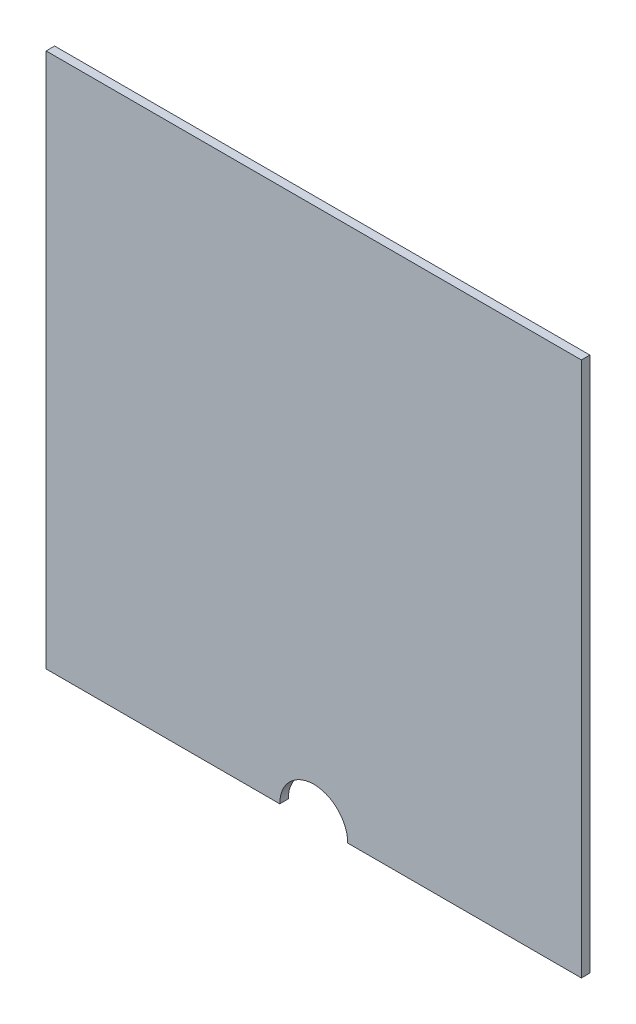
ISO-10303-21;
HEADER;
FILE_DESCRIPTION(('STEP AP214'),'2;1');
FILE_NAME('part.step','',(''),(''),'','','');
FILE_SCHEMA(('AUTOMOTIVE_DESIGN { 1 0 10303 214 1 1 1 1 }'));
ENDSEC;
DATA;
#1=APPLICATION_CONTEXT('core data for automotive mechanical design processes');
#2=APPLICATION_PROTOCOL_DEFINITION('international standard','automotive_design',2000,#1);
#3=PRODUCT_CONTEXT('',#1,'mechanical');
#4=PRODUCT('Part','Part','',(#3));
#5=PRODUCT_RELATED_PRODUCT_CATEGORY('part','',(#4));
#6=PRODUCT_DEFINITION_FORMATION('','',#4);
#7=PRODUCT_DEFINITION_CONTEXT('part definition',#1,'design');
#8=PRODUCT_DEFINITION('design','',#6,#7);
#9=PRODUCT_DEFINITION_SHAPE('','',#8);
#10=(LENGTH_UNIT() NAMED_UNIT(*) SI_UNIT(.MILLI.,.METRE.));
#11=(NAMED_UNIT(*) PLANE_ANGLE_UNIT() SI_UNIT($,.RADIAN.));
#12=(NAMED_UNIT(*) SI_UNIT($,.STERADIAN.) SOLID_ANGLE_UNIT());
#13=UNCERTAINTY_MEASURE_WITH_UNIT(LENGTH_MEASURE(1.E-05),#10,'distance_accuracy_value','');
#14=(GEOMETRIC_REPRESENTATION_CONTEXT(3) GLOBAL_UNCERTAINTY_ASSIGNED_CONTEXT((#13)) GLOBAL_UNIT_ASSIGNED_CONTEXT((#10,
#11,#12)) REPRESENTATION_CONTEXT('',''));
#15=CARTESIAN_POINT('',(0.,0.,0.));
#16=DIRECTION('',(0.,0.,1.));
#17=DIRECTION('',(1.,0.,0.));
#18=AXIS2_PLACEMENT_3D('',#15,#16,#17);
#19=CARTESIAN_POINT('',(99.9999999999999,0.,3.175));
#20=DIRECTION('',(0.,0.,-1.));
#21=DIRECTION('',(-1.,0.,0.));
#22=AXIS2_PLACEMENT_3D('',#19,#20,#21);
#23=CYLINDRICAL_SURFACE('',#22,12.7);
#24=CARTESIAN_POINT('',(99.9999999999999,0.,0.));
#25=DIRECTION('',(0.,0.,-1.));
#26=DIRECTION('',(1.,0.,0.));
#27=AXIS2_PLACEMENT_3D('',#24,#25,#26);
#28=CIRCLE('',#27,12.7);
#29=CARTESIAN_POINT('',(87.2999999999999,0.,0.));
#30=VERTEX_POINT('',#29);
#31=CARTESIAN_POINT('',(112.7,0.,0.));
#32=VERTEX_POINT('',#31);
#33=EDGE_CURVE('E119',#30,#32,#28,.T.);
#34=ORIENTED_EDGE('',*,*,#33,.T.);
#35=DIRECTION('',(0.,0.,-1.));
#36=VECTOR('',#35,1.);
#37=CARTESIAN_POINT('',(112.7,0.,3.175));
#38=LINE('',#37,#36);
#39=CARTESIAN_POINT('',(112.7,0.,3.175));
#40=VERTEX_POINT('',#39);
#41=EDGE_CURVE('E11',#40,#32,#38,.T.);
#42=ORIENTED_EDGE('',*,*,#41,.F.);
#43=CARTESIAN_POINT('',(99.9999999999999,0.,3.175));
#44=DIRECTION('',(0.,0.,-1.));
#45=DIRECTION('',(1.,0.,0.));
#46=AXIS2_PLACEMENT_3D('',#43,#44,#45);
#47=CIRCLE('',#46,12.7);
#48=CARTESIAN_POINT('',(87.2999999999999,0.,3.175));
#49=VERTEX_POINT('',#48);
#50=EDGE_CURVE('E129',#49,#40,#47,.T.);
#51=ORIENTED_EDGE('',*,*,#50,.F.);
#52=DIRECTION('',(0.,0.,-1.));
#53=VECTOR('',#52,1.);
#54=CARTESIAN_POINT('',(87.2999999999999,0.,3.175));
#55=LINE('',#54,#53);
#56=EDGE_CURVE('E115',#49,#30,#55,.T.);
#57=ORIENTED_EDGE('',*,*,#56,.T.);
#58=EDGE_LOOP('',(#34,#42,#51,#57));
#59=FACE_BOUND('',#58,.T.);
#60=ADVANCED_FACE('F35',(#59),#23,.F.);
#61=CARTESIAN_POINT('',(112.7,0.,3.175));
#62=DIRECTION('',(0.,1.,0.));
#63=DIRECTION('',(0.,0.,1.));
#64=AXIS2_PLACEMENT_3D('',#61,#62,#63);
#65=PLANE('',#64);
#66=DIRECTION('',(1.,0.,0.));
#67=VECTOR('',#66,1.);
#68=CARTESIAN_POINT('',(112.7,0.,0.));
#69=LINE('',#68,#67);
#70=CARTESIAN_POINT('',(200.,0.,0.));
#71=VERTEX_POINT('',#70);
#72=EDGE_CURVE('E122',#32,#71,#69,.T.);
#73=ORIENTED_EDGE('',*,*,#72,.T.);
#74=DIRECTION('',(0.,0.,-1.));
#75=VECTOR('',#74,1.);
#76=CARTESIAN_POINT('',(200.,0.,3.175));
#77=LINE('',#76,#75);
#78=CARTESIAN_POINT('',(200.,0.,3.175));
#79=VERTEX_POINT('',#78);
#80=EDGE_CURVE('E43',#79,#71,#77,.T.);
#81=ORIENTED_EDGE('',*,*,#80,.F.);
#82=DIRECTION('',(1.,0.,0.));
#83=VECTOR('',#82,1.);
#84=CARTESIAN_POINT('',(112.7,0.,3.175));
#85=LINE('',#84,#83);
#86=EDGE_CURVE('E88',#40,#79,#85,.T.);
#87=ORIENTED_EDGE('',*,*,#86,.F.);
#88=ORIENTED_EDGE('',*,*,#41,.T.);
#89=EDGE_LOOP('',(#73,#81,#87,#88));
#90=FACE_BOUND('',#89,.T.);
#91=ADVANCED_FACE('F153',(#90),#65,.F.);
#92=CARTESIAN_POINT('',(200.,0.,3.175));
#93=DIRECTION('',(-1.,0.,0.));
#94=DIRECTION('',(0.,0.,1.));
#95=AXIS2_PLACEMENT_3D('',#92,#93,#94);
#96=PLANE('',#95);
#97=DIRECTION('',(0.,1.,0.));
#98=VECTOR('',#97,1.);
#99=CARTESIAN_POINT('',(200.,0.,0.));
#100=LINE('',#99,#98);
#101=CARTESIAN_POINT('',(200.,200.,0.));
#102=VERTEX_POINT('',#101);
#103=EDGE_CURVE('E124',#71,#102,#100,.T.);
#104=ORIENTED_EDGE('',*,*,#103,.T.);
#105=DIRECTION('',(0.,0.,-1.));
#106=VECTOR('',#105,1.);
#107=CARTESIAN_POINT('',(200.,200.,3.175));
#108=LINE('',#107,#106);
#109=CARTESIAN_POINT('',(200.,200.,3.175));
#110=VERTEX_POINT('',#109);
#111=EDGE_CURVE('E110',#110,#102,#108,.T.);
#112=ORIENTED_EDGE('',*,*,#111,.F.);
#113=DIRECTION('',(0.,1.,0.));
#114=VECTOR('',#113,1.);
#115=CARTESIAN_POINT('',(200.,0.,3.175));
#116=LINE('',#115,#114);
#117=EDGE_CURVE('E101',#79,#110,#116,.T.);
#118=ORIENTED_EDGE('',*,*,#117,.F.);
#119=ORIENTED_EDGE('',*,*,#80,.T.);
#120=EDGE_LOOP('',(#104,#112,#118,#119));
#121=FACE_BOUND('',#120,.T.);
#122=ADVANCED_FACE('F135',(#121),#96,.F.);
#123=CARTESIAN_POINT('',(200.,200.,3.175));
#124=DIRECTION('',(0.,-1.,0.));
#125=DIRECTION('',(1.,0.,0.));
#126=AXIS2_PLACEMENT_3D('',#123,#124,#125);
#127=PLANE('',#126);
#128=DIRECTION('',(-1.,0.,0.));
#129=VECTOR('',#128,1.);
#130=CARTESIAN_POINT('',(200.,200.,0.));
#131=LINE('',#130,#129);
#132=CARTESIAN_POINT('',(2.22044604925031E-13,200.,0.));
#133=VERTEX_POINT('',#132);
#134=EDGE_CURVE('E109',#102,#133,#131,.T.);
#135=ORIENTED_EDGE('',*,*,#134,.T.);
#136=DIRECTION('',(0.,0.,-1.));
#137=VECTOR('',#136,1.);
#138=CARTESIAN_POINT('',(2.22044604925031E-13,200.,3.175));
#139=LINE('',#138,#137);
#140=CARTESIAN_POINT('',(2.22044604925031E-13,200.,3.175));
#141=VERTEX_POINT('',#140);
#142=EDGE_CURVE('E106',#141,#133,#139,.T.);
#143=ORIENTED_EDGE('',*,*,#142,.F.);
#144=DIRECTION('',(-1.,0.,0.));
#145=VECTOR('',#144,1.);
#146=CARTESIAN_POINT('',(200.,200.,3.175));
#147=LINE('',#146,#145);
#148=EDGE_CURVE('E95',#110,#141,#147,.T.);
#149=ORIENTED_EDGE('',*,*,#148,.F.);
#150=ORIENTED_EDGE('',*,*,#111,.T.);
#151=EDGE_LOOP('',(#135,#143,#149,#150));
#152=FACE_BOUND('',#151,.T.);
#153=ADVANCED_FACE('F107',(#152),#127,.F.);
#154=CARTESIAN_POINT('',(2.22044604925031E-13,200.,3.175));
#155=DIRECTION('',(1.,0.,0.));
#156=DIRECTION('',(0.,1.,0.));
#157=AXIS2_PLACEMENT_3D('',#154,#155,#156);
#158=PLANE('',#157);
#159=DIRECTION('',(0.,-1.,0.));
#160=VECTOR('',#159,1.);
#161=CARTESIAN_POINT('',(2.22044604925031E-13,200.,0.));
#162=LINE('',#161,#160);
#163=CARTESIAN_POINT('',(0.,0.,0.));
#164=VERTEX_POINT('',#163);
#165=EDGE_CURVE('E74',#133,#164,#162,.T.);
#166=ORIENTED_EDGE('',*,*,#165,.T.);
#167=DIRECTION('',(0.,0.,-1.));
#168=VECTOR('',#167,1.);
#169=CARTESIAN_POINT('',(0.,0.,3.175));
#170=LINE('',#169,#168);
#171=CARTESIAN_POINT('',(0.,0.,3.175));
#172=VERTEX_POINT('',#171);
#173=EDGE_CURVE('E111',#172,#164,#170,.T.);
#174=ORIENTED_EDGE('',*,*,#173,.F.);
#175=DIRECTION('',(0.,-1.,0.));
#176=VECTOR('',#175,1.);
#177=CARTESIAN_POINT('',(2.22044604925031E-13,200.,3.175));
#178=LINE('',#177,#176);
#179=EDGE_CURVE('E99',#141,#172,#178,.T.);
#180=ORIENTED_EDGE('',*,*,#179,.F.);
#181=ORIENTED_EDGE('',*,*,#142,.T.);
#182=EDGE_LOOP('',(#166,#174,#180,#181));
#183=FACE_BOUND('',#182,.T.);
#184=ADVANCED_FACE('F113',(#183),#158,.F.);
#185=CARTESIAN_POINT('',(0.,0.,3.175));
#186=DIRECTION('',(0.,1.,0.));
#187=DIRECTION('',(0.,0.,1.));
#188=AXIS2_PLACEMENT_3D('',#185,#186,#187);
#189=PLANE('',#188);
#190=DIRECTION('',(1.,0.,0.));
#191=VECTOR('',#190,1.);
#192=CARTESIAN_POINT('',(0.,0.,0.));
#193=LINE('',#192,#191);
#194=EDGE_CURVE('E80',#164,#30,#193,.T.);
#195=ORIENTED_EDGE('',*,*,#194,.T.);
#196=ORIENTED_EDGE('',*,*,#56,.F.);
#197=DIRECTION('',(1.,0.,0.));
#198=VECTOR('',#197,1.);
#199=CARTESIAN_POINT('',(0.,0.,3.175));
#200=LINE('',#199,#198);
#201=EDGE_CURVE('E51',#172,#49,#200,.T.);
#202=ORIENTED_EDGE('',*,*,#201,.F.);
#203=ORIENTED_EDGE('',*,*,#173,.T.);
#204=EDGE_LOOP('',(#195,#196,#202,#203));
#205=FACE_BOUND('',#204,.T.);
#206=ADVANCED_FACE('F142',(#205),#189,.F.);
#207=CARTESIAN_POINT('',(99.9999999999999,0.,3.175));
#208=DIRECTION('',(0.,0.,1.));
#209=DIRECTION('',(1.,0.,0.));
#210=AXIS2_PLACEMENT_3D('',#207,#208,#209);
#211=PLANE('',#210);
#212=ORIENTED_EDGE('',*,*,#50,.T.);
#213=ORIENTED_EDGE('',*,*,#86,.T.);
#214=ORIENTED_EDGE('',*,*,#117,.T.);
#215=ORIENTED_EDGE('',*,*,#148,.T.);
#216=ORIENTED_EDGE('',*,*,#179,.T.);
#217=ORIENTED_EDGE('',*,*,#201,.T.);
#218=EDGE_LOOP('',(#212,#213,#214,#215,#216,#217));
#219=FACE_BOUND('',#218,.T.);
#220=ADVANCED_FACE('F97',(#219),#211,.T.);
#221=CARTESIAN_POINT('',(99.9999999999999,0.,0.));
#222=DIRECTION('',(0.,0.,1.));
#223=DIRECTION('',(1.,0.,0.));
#224=AXIS2_PLACEMENT_3D('',#221,#222,#223);
#225=PLANE('',#224);
#226=ORIENTED_EDGE('',*,*,#33,.F.);
#227=ORIENTED_EDGE('',*,*,#194,.F.);
#228=ORIENTED_EDGE('',*,*,#165,.F.);
#229=ORIENTED_EDGE('',*,*,#134,.F.);
#230=ORIENTED_EDGE('',*,*,#103,.F.);
#231=ORIENTED_EDGE('',*,*,#72,.F.);
#232=EDGE_LOOP('',(#226,#227,#228,#229,#230,#231));
#233=FACE_BOUND('',#232,.T.);
#234=ADVANCED_FACE('F138',(#233),#225,.F.);
#235=CLOSED_SHELL('',(#60,#91,#122,#153,#184,#206,#220,#234));
#236=MANIFOLD_SOLID_BREP('B2',#235);
#237=ADVANCED_BREP_SHAPE_REPRESENTATION('',(#18,#236),#14);
#238=SHAPE_DEFINITION_REPRESENTATION(#9,#237);
ENDSEC;
END-ISO-10303-21;
